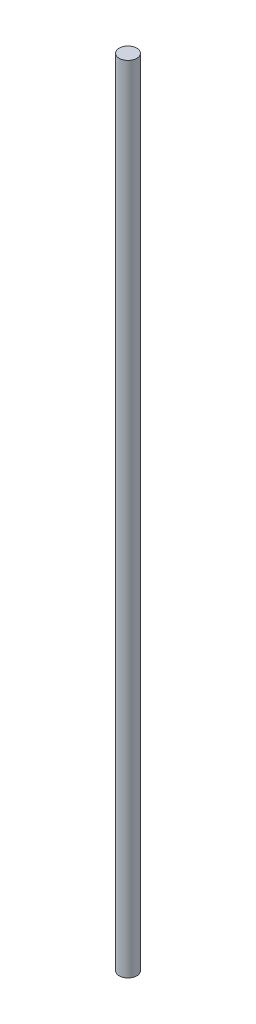
ISO-10303-21;
HEADER;
FILE_DESCRIPTION(('STEP AP214'),'2;1');
FILE_NAME('part.step','',(''),(''),'','','');
FILE_SCHEMA(('AUTOMOTIVE_DESIGN { 1 0 10303 214 1 1 1 1 }'));
ENDSEC;
DATA;
#1=APPLICATION_CONTEXT('core data for automotive mechanical design processes');
#2=APPLICATION_PROTOCOL_DEFINITION('international standard','automotive_design',2000,#1);
#3=PRODUCT_CONTEXT('',#1,'mechanical');
#4=PRODUCT('Part','Part','',(#3));
#5=PRODUCT_RELATED_PRODUCT_CATEGORY('part','',(#4));
#6=PRODUCT_DEFINITION_FORMATION('','',#4);
#7=PRODUCT_DEFINITION_CONTEXT('part definition',#1,'design');
#8=PRODUCT_DEFINITION('design','',#6,#7);
#9=PRODUCT_DEFINITION_SHAPE('','',#8);
#10=(LENGTH_UNIT() NAMED_UNIT(*) SI_UNIT(.MILLI.,.METRE.));
#11=(NAMED_UNIT(*) PLANE_ANGLE_UNIT() SI_UNIT($,.RADIAN.));
#12=(NAMED_UNIT(*) SI_UNIT($,.STERADIAN.) SOLID_ANGLE_UNIT());
#13=UNCERTAINTY_MEASURE_WITH_UNIT(LENGTH_MEASURE(1.E-05),#10,'distance_accuracy_value','');
#14=(GEOMETRIC_REPRESENTATION_CONTEXT(3) GLOBAL_UNCERTAINTY_ASSIGNED_CONTEXT((#13)) GLOBAL_UNIT_ASSIGNED_CONTEXT((#10,
#11,#12)) REPRESENTATION_CONTEXT('',''));
#15=CARTESIAN_POINT('',(0.,0.,0.));
#16=DIRECTION('',(0.,0.,1.));
#17=DIRECTION('',(1.,0.,0.));
#18=AXIS2_PLACEMENT_3D('',#15,#16,#17);
#19=CARTESIAN_POINT('',(0.,360.,0.));
#20=DIRECTION('',(0.,-1.,0.));
#21=DIRECTION('',(0.,0.,-1.));
#22=AXIS2_PLACEMENT_3D('',#19,#20,#21);
#23=CYLINDRICAL_SURFACE('',#22,4.);
#24=CARTESIAN_POINT('',(0.,360.,0.));
#25=DIRECTION('',(0.,1.,0.));
#26=DIRECTION('',(0.,0.,1.));
#27=AXIS2_PLACEMENT_3D('',#24,#25,#26);
#28=CIRCLE('',#27,4.);
#29=CARTESIAN_POINT('',(0.,360.,4.));
#30=VERTEX_POINT('',#29);
#31=EDGE_CURVE('E10',#30,#30,#28,.T.);
#32=ORIENTED_EDGE('',*,*,#31,.F.);
#33=EDGE_LOOP('',(#32));
#34=FACE_BOUND('',#33,.T.);
#35=CARTESIAN_POINT('',(0.,0.,0.));
#36=DIRECTION('',(0.,1.,0.));
#37=DIRECTION('',(0.,0.,1.));
#38=AXIS2_PLACEMENT_3D('',#35,#36,#37);
#39=CIRCLE('',#38,4.);
#40=CARTESIAN_POINT('',(0.,0.,4.));
#41=VERTEX_POINT('',#40);
#42=EDGE_CURVE('E33',#41,#41,#39,.T.);
#43=ORIENTED_EDGE('',*,*,#42,.T.);
#44=EDGE_LOOP('',(#43));
#45=FACE_BOUND('',#44,.T.);
#46=ADVANCED_FACE('F30',(#34,#45),#23,.T.);
#47=CARTESIAN_POINT('',(0.,360.,0.));
#48=DIRECTION('',(0.,1.,0.));
#49=DIRECTION('',(0.,0.,1.));
#50=AXIS2_PLACEMENT_3D('',#47,#48,#49);
#51=PLANE('',#50);
#52=ORIENTED_EDGE('',*,*,#31,.T.);
#53=EDGE_LOOP('',(#52));
#54=FACE_BOUND('',#53,.T.);
#55=ADVANCED_FACE('F45',(#54),#51,.T.);
#56=CARTESIAN_POINT('',(0.,0.,0.));
#57=DIRECTION('',(0.,1.,0.));
#58=DIRECTION('',(0.,0.,1.));
#59=AXIS2_PLACEMENT_3D('',#56,#57,#58);
#60=PLANE('',#59);
#61=ORIENTED_EDGE('',*,*,#42,.F.);
#62=EDGE_LOOP('',(#61));
#63=FACE_BOUND('',#62,.T.);
#64=ADVANCED_FACE('F43',(#63),#60,.F.);
#65=CLOSED_SHELL('',(#46,#55,#64));
#66=MANIFOLD_SOLID_BREP('B2',#65);
#67=ADVANCED_BREP_SHAPE_REPRESENTATION('',(#18,#66),#14);
#68=SHAPE_DEFINITION_REPRESENTATION(#9,#67);
ENDSEC;
END-ISO-10303-21;
